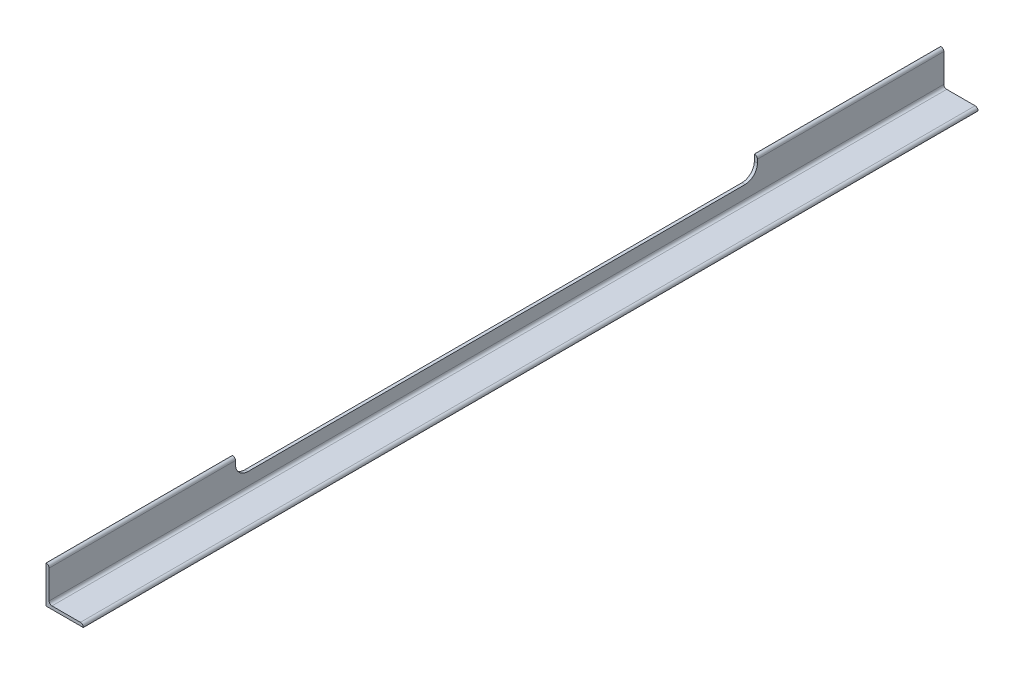
ISO-10303-21;
HEADER;
FILE_DESCRIPTION(('STEP AP214'),'2;1');
FILE_NAME('part.step','',(''),(''),'','','');
FILE_SCHEMA(('AUTOMOTIVE_DESIGN { 1 0 10303 214 1 1 1 1 }'));
ENDSEC;
DATA;
#1=APPLICATION_CONTEXT('core data for automotive mechanical design processes');
#2=APPLICATION_PROTOCOL_DEFINITION('international standard','automotive_design',2000,#1);
#3=PRODUCT_CONTEXT('',#1,'mechanical');
#4=PRODUCT('Part','Part','',(#3));
#5=PRODUCT_RELATED_PRODUCT_CATEGORY('part','',(#4));
#6=PRODUCT_DEFINITION_FORMATION('','',#4);
#7=PRODUCT_DEFINITION_CONTEXT('part definition',#1,'design');
#8=PRODUCT_DEFINITION('design','',#6,#7);
#9=PRODUCT_DEFINITION_SHAPE('','',#8);
#10=(LENGTH_UNIT() NAMED_UNIT(*) SI_UNIT(.MILLI.,.METRE.));
#11=(NAMED_UNIT(*) PLANE_ANGLE_UNIT() SI_UNIT($,.RADIAN.));
#12=(NAMED_UNIT(*) SI_UNIT($,.STERADIAN.) SOLID_ANGLE_UNIT());
#13=UNCERTAINTY_MEASURE_WITH_UNIT(LENGTH_MEASURE(1.E-05),#10,'distance_accuracy_value','');
#14=(GEOMETRIC_REPRESENTATION_CONTEXT(3) GLOBAL_UNCERTAINTY_ASSIGNED_CONTEXT((#13)) GLOBAL_UNIT_ASSIGNED_CONTEXT((#10,
#11,#12)) REPRESENTATION_CONTEXT('',''));
#15=CARTESIAN_POINT('',(0.,0.,0.));
#16=DIRECTION('',(0.,0.,1.));
#17=DIRECTION('',(1.,0.,0.));
#18=AXIS2_PLACEMENT_3D('',#15,#16,#17);
#19=CARTESIAN_POINT('',(0.508,70.358,4212.82368));
#20=DIRECTION('',(0.,0.,-1.));
#21=DIRECTION('',(-1.,0.,0.));
#22=AXIS2_PLACEMENT_3D('',#19,#20,#21);
#23=CYLINDRICAL_SURFACE('',#22,5.842);
#24=DIRECTION('',(0.,0.,-1.));
#25=VECTOR('',#24,1.);
#26=CARTESIAN_POINT('',(6.35,70.358,0.));
#27=LINE('',#26,#25);
#28=CARTESIAN_POINT('',(6.35,70.358,1447.8));
#29=VERTEX_POINT('',#28);
#30=CARTESIAN_POINT('',(6.35,70.358,1828.8));
#31=VERTEX_POINT('',#30);
#32=EDGE_CURVE('E139',#29,#31,#27,.F.);
#33=ORIENTED_EDGE('',*,*,#32,.F.);
#34=CARTESIAN_POINT('',(0.508,70.358,1447.8));
#35=DIRECTION('',(0.,0.,-1.));
#36=DIRECTION('',(-1.,0.,0.));
#37=AXIS2_PLACEMENT_3D('',#34,#35,#36);
#38=CIRCLE('',#37,5.842);
#39=CARTESIAN_POINT('',(0.508,76.2,1447.8));
#40=VERTEX_POINT('',#39);
#41=EDGE_CURVE('E19',#29,#40,#38,.F.);
#42=ORIENTED_EDGE('',*,*,#41,.T.);
#43=DIRECTION('',(0.,0.,1.));
#44=VECTOR('',#43,1.);
#45=CARTESIAN_POINT('',(0.508,76.2,0.));
#46=LINE('',#45,#44);
#47=CARTESIAN_POINT('',(0.508,76.2,1828.8));
#48=VERTEX_POINT('',#47);
#49=EDGE_CURVE('E137',#48,#40,#46,.F.);
#50=ORIENTED_EDGE('',*,*,#49,.F.);
#51=CARTESIAN_POINT('',(0.508,70.358,1828.8));
#52=DIRECTION('',(0.,0.,-1.));
#53=DIRECTION('',(-1.,0.,0.));
#54=AXIS2_PLACEMENT_3D('',#51,#52,#53);
#55=CIRCLE('',#54,5.842);
#56=EDGE_CURVE('E141',#31,#48,#55,.F.);
#57=ORIENTED_EDGE('',*,*,#56,.F.);
#58=EDGE_LOOP('',(#33,#42,#50,#57));
#59=FACE_BOUND('',#58,.T.);
#60=ADVANCED_FACE('F16',(#59),#23,.T.);
#61=CARTESIAN_POINT('',(6.35,76.2,0.));
#62=DIRECTION('',(0.,1.,0.));
#63=DIRECTION('',(0.,0.,1.));
#64=AXIS2_PLACEMENT_3D('',#61,#62,#63);
#65=PLANE('',#64);
#66=DIRECTION('',(0.,0.,1.));
#67=VECTOR('',#66,1.);
#68=CARTESIAN_POINT('',(0.,76.2,0.));
#69=LINE('',#68,#67);
#70=CARTESIAN_POINT('',(0.,76.2,381.));
#71=VERTEX_POINT('',#70);
#72=CARTESIAN_POINT('',(0.,76.2,0.));
#73=VERTEX_POINT('',#72);
#74=EDGE_CURVE('E193',#71,#73,#69,.F.);
#75=ORIENTED_EDGE('',*,*,#74,.F.);
#76=DIRECTION('',(-1.,0.,0.));
#77=VECTOR('',#76,1.);
#78=CARTESIAN_POINT('',(0.,76.2,381.));
#79=LINE('',#78,#77);
#80=CARTESIAN_POINT('',(0.508,76.2,381.));
#81=VERTEX_POINT('',#80);
#82=EDGE_CURVE('E186',#71,#81,#79,.F.);
#83=ORIENTED_EDGE('',*,*,#82,.T.);
#84=DIRECTION('',(0.,0.,-1.));
#85=VECTOR('',#84,1.);
#86=CARTESIAN_POINT('',(0.508,76.2,4212.82368));
#87=LINE('',#86,#85);
#88=CARTESIAN_POINT('',(0.508,76.2,0.));
#89=VERTEX_POINT('',#88);
#90=EDGE_CURVE('E183',#89,#81,#87,.F.);
#91=ORIENTED_EDGE('',*,*,#90,.F.);
#92=DIRECTION('',(1.,0.,0.));
#93=VECTOR('',#92,1.);
#94=CARTESIAN_POINT('',(6.35,76.2,0.));
#95=LINE('',#94,#93);
#96=EDGE_CURVE('E224',#89,#73,#95,.F.);
#97=ORIENTED_EDGE('',*,*,#96,.T.);
#98=EDGE_LOOP('',(#75,#83,#91,#97));
#99=FACE_BOUND('',#98,.T.);
#100=ADVANCED_FACE('F279',(#99),#65,.T.);
#101=CARTESIAN_POINT('',(6.35,76.2,0.));
#102=DIRECTION('',(0.,1.,0.));
#103=DIRECTION('',(0.,0.,1.));
#104=AXIS2_PLACEMENT_3D('',#101,#102,#103);
#105=PLANE('',#104);
#106=ORIENTED_EDGE('',*,*,#49,.T.);
#107=DIRECTION('',(1.,0.,0.));
#108=VECTOR('',#107,1.);
#109=CARTESIAN_POINT('',(0.,76.2,1447.8));
#110=LINE('',#109,#108);
#111=CARTESIAN_POINT('',(0.,76.2,1447.8));
#112=VERTEX_POINT('',#111);
#113=EDGE_CURVE('E134',#40,#112,#110,.F.);
#114=ORIENTED_EDGE('',*,*,#113,.T.);
#115=DIRECTION('',(0.,0.,1.));
#116=VECTOR('',#115,1.);
#117=CARTESIAN_POINT('',(0.,76.2,0.));
#118=LINE('',#117,#116);
#119=CARTESIAN_POINT('',(0.,76.2,1828.8));
#120=VERTEX_POINT('',#119);
#121=EDGE_CURVE('E206',#120,#112,#118,.F.);
#122=ORIENTED_EDGE('',*,*,#121,.F.);
#123=DIRECTION('',(1.,0.,0.));
#124=VECTOR('',#123,1.);
#125=CARTESIAN_POINT('',(0.,76.2,1828.8));
#126=LINE('',#125,#124);
#127=EDGE_CURVE('E173',#48,#120,#126,.F.);
#128=ORIENTED_EDGE('',*,*,#127,.F.);
#129=EDGE_LOOP('',(#106,#114,#122,#128));
#130=FACE_BOUND('',#129,.T.);
#131=ADVANCED_FACE('F310',(#130),#105,.T.);
#132=CARTESIAN_POINT('',(0.,63.5,1447.8));
#133=DIRECTION('',(0.,0.,1.));
#134=DIRECTION('',(1.,0.,0.));
#135=AXIS2_PLACEMENT_3D('',#132,#133,#134);
#136=PLANE('',#135);
#137=DIRECTION('',(0.,1.,0.));
#138=VECTOR('',#137,1.);
#139=CARTESIAN_POINT('',(0.,76.2,1447.8));
#140=LINE('',#139,#138);
#141=CARTESIAN_POINT('',(0.,63.5,1447.8));
#142=VERTEX_POINT('',#141);
#143=EDGE_CURVE('E209',#112,#142,#140,.F.);
#144=ORIENTED_EDGE('',*,*,#143,.F.);
#145=ORIENTED_EDGE('',*,*,#113,.F.);
#146=ORIENTED_EDGE('',*,*,#41,.F.);
#147=DIRECTION('',(0.,1.,0.));
#148=VECTOR('',#147,1.);
#149=CARTESIAN_POINT('',(6.35,6.35,1447.8));
#150=LINE('',#149,#148);
#151=CARTESIAN_POINT('',(6.35,63.5,1447.8));
#152=VERTEX_POINT('',#151);
#153=EDGE_CURVE('E132',#152,#29,#150,.T.);
#154=ORIENTED_EDGE('',*,*,#153,.F.);
#155=DIRECTION('',(-1.,0.,0.));
#156=VECTOR('',#155,1.);
#157=CARTESIAN_POINT('',(0.,63.5,1447.8));
#158=LINE('',#157,#156);
#159=EDGE_CURVE('E201',#152,#142,#158,.T.);
#160=ORIENTED_EDGE('',*,*,#159,.T.);
#161=EDGE_LOOP('',(#144,#145,#146,#154,#160));
#162=FACE_BOUND('',#161,.T.);
#163=ADVANCED_FACE('F130',(#162),#136,.F.);
#164=CARTESIAN_POINT('',(0.,63.5,1422.4));
#165=DIRECTION('',(-1.,0.,0.));
#166=DIRECTION('',(0.,0.,1.));
#167=AXIS2_PLACEMENT_3D('',#164,#165,#166);
#168=CYLINDRICAL_SURFACE('',#167,25.4);
#169=CARTESIAN_POINT('',(0.,63.5,1422.4));
#170=DIRECTION('',(-1.,0.,0.));
#171=DIRECTION('',(0.,0.,1.));
#172=AXIS2_PLACEMENT_3D('',#169,#170,#171);
#173=CIRCLE('',#172,25.4);
#174=CARTESIAN_POINT('',(0.,38.1,1422.4));
#175=VERTEX_POINT('',#174);
#176=EDGE_CURVE('E246',#142,#175,#173,.F.);
#177=ORIENTED_EDGE('',*,*,#176,.F.);
#178=ORIENTED_EDGE('',*,*,#159,.F.);
#179=CARTESIAN_POINT('',(6.35,63.5,1422.4));
#180=DIRECTION('',(-1.,0.,0.));
#181=DIRECTION('',(0.,0.,1.));
#182=AXIS2_PLACEMENT_3D('',#179,#180,#181);
#183=CIRCLE('',#182,25.4);
#184=CARTESIAN_POINT('',(6.35,38.1,1422.4));
#185=VERTEX_POINT('',#184);
#186=EDGE_CURVE('E151',#185,#152,#183,.T.);
#187=ORIENTED_EDGE('',*,*,#186,.F.);
#188=DIRECTION('',(1.,0.,0.));
#189=VECTOR('',#188,1.);
#190=CARTESIAN_POINT('',(0.,38.1,1422.4));
#191=LINE('',#190,#189);
#192=EDGE_CURVE('E199',#185,#175,#191,.F.);
#193=ORIENTED_EDGE('',*,*,#192,.T.);
#194=EDGE_LOOP('',(#177,#178,#187,#193));
#195=FACE_BOUND('',#194,.T.);
#196=ADVANCED_FACE('F438',(#195),#168,.F.);
#197=CARTESIAN_POINT('',(0.,38.1,406.4));
#198=DIRECTION('',(0.,-1.,0.));
#199=DIRECTION('',(0.,0.,-1.));
#200=AXIS2_PLACEMENT_3D('',#197,#198,#199);
#201=PLANE('',#200);
#202=DIRECTION('',(0.,0.,1.));
#203=VECTOR('',#202,1.);
#204=CARTESIAN_POINT('',(0.,38.1,0.));
#205=LINE('',#204,#203);
#206=CARTESIAN_POINT('',(0.,38.1,406.4));
#207=VERTEX_POINT('',#206);
#208=EDGE_CURVE('E245',#175,#207,#205,.F.);
#209=ORIENTED_EDGE('',*,*,#208,.F.);
#210=ORIENTED_EDGE('',*,*,#192,.F.);
#211=DIRECTION('',(0.,0.,-1.));
#212=VECTOR('',#211,1.);
#213=CARTESIAN_POINT('',(6.35,38.1,0.));
#214=LINE('',#213,#212);
#215=CARTESIAN_POINT('',(6.35,38.1,406.4));
#216=VERTEX_POINT('',#215);
#217=EDGE_CURVE('E153',#216,#185,#214,.F.);
#218=ORIENTED_EDGE('',*,*,#217,.F.);
#219=DIRECTION('',(-1.,0.,0.));
#220=VECTOR('',#219,1.);
#221=CARTESIAN_POINT('',(0.,38.1,406.4));
#222=LINE('',#221,#220);
#223=EDGE_CURVE('E192',#216,#207,#222,.T.);
#224=ORIENTED_EDGE('',*,*,#223,.T.);
#225=EDGE_LOOP('',(#209,#210,#218,#224));
#226=FACE_BOUND('',#225,.T.);
#227=ADVANCED_FACE('F429',(#226),#201,.F.);
#228=CARTESIAN_POINT('',(0.,63.5,406.4));
#229=DIRECTION('',(-1.,0.,0.));
#230=DIRECTION('',(0.,0.,1.));
#231=AXIS2_PLACEMENT_3D('',#228,#229,#230);
#232=CYLINDRICAL_SURFACE('',#231,25.4);
#233=CARTESIAN_POINT('',(0.,63.5,406.4));
#234=DIRECTION('',(-1.,0.,0.));
#235=DIRECTION('',(0.,0.,1.));
#236=AXIS2_PLACEMENT_3D('',#233,#234,#235);
#237=CIRCLE('',#236,25.4);
#238=CARTESIAN_POINT('',(0.,63.5,381.));
#239=VERTEX_POINT('',#238);
#240=EDGE_CURVE('E242',#207,#239,#237,.F.);
#241=ORIENTED_EDGE('',*,*,#240,.F.);
#242=ORIENTED_EDGE('',*,*,#223,.F.);
#243=CARTESIAN_POINT('',(6.35,63.5,406.4));
#244=DIRECTION('',(-1.,0.,0.));
#245=DIRECTION('',(0.,0.,1.));
#246=AXIS2_PLACEMENT_3D('',#243,#244,#245);
#247=CIRCLE('',#246,25.4);
#248=CARTESIAN_POINT('',(6.35,63.5,381.));
#249=VERTEX_POINT('',#248);
#250=EDGE_CURVE('E160',#249,#216,#247,.T.);
#251=ORIENTED_EDGE('',*,*,#250,.F.);
#252=DIRECTION('',(-1.,0.,0.));
#253=VECTOR('',#252,1.);
#254=CARTESIAN_POINT('',(0.,63.5,381.));
#255=LINE('',#254,#253);
#256=EDGE_CURVE('E188',#249,#239,#255,.T.);
#257=ORIENTED_EDGE('',*,*,#256,.T.);
#258=EDGE_LOOP('',(#241,#242,#251,#257));
#259=FACE_BOUND('',#258,.T.);
#260=ADVANCED_FACE('F421',(#259),#232,.F.);
#261=CARTESIAN_POINT('',(0.,76.2,381.));
#262=DIRECTION('',(0.,0.,-1.));
#263=DIRECTION('',(-1.,0.,0.));
#264=AXIS2_PLACEMENT_3D('',#261,#262,#263);
#265=PLANE('',#264);
#266=ORIENTED_EDGE('',*,*,#82,.F.);
#267=DIRECTION('',(0.,1.,0.));
#268=VECTOR('',#267,1.);
#269=CARTESIAN_POINT('',(0.,76.2,381.));
#270=LINE('',#269,#268);
#271=EDGE_CURVE('E241',#239,#71,#270,.T.);
#272=ORIENTED_EDGE('',*,*,#271,.F.);
#273=ORIENTED_EDGE('',*,*,#256,.F.);
#274=DIRECTION('',(0.,1.,0.));
#275=VECTOR('',#274,1.);
#276=CARTESIAN_POINT('',(6.35,6.35,381.));
#277=LINE('',#276,#275);
#278=CARTESIAN_POINT('',(6.35,70.358,381.));
#279=VERTEX_POINT('',#278);
#280=EDGE_CURVE('E157',#279,#249,#277,.F.);
#281=ORIENTED_EDGE('',*,*,#280,.F.);
#282=CARTESIAN_POINT('',(0.508,70.358,381.));
#283=DIRECTION('',(0.,0.,-1.));
#284=DIRECTION('',(-1.,0.,0.));
#285=AXIS2_PLACEMENT_3D('',#282,#283,#284);
#286=CIRCLE('',#285,5.842);
#287=EDGE_CURVE('E170',#81,#279,#286,.T.);
#288=ORIENTED_EDGE('',*,*,#287,.F.);
#289=EDGE_LOOP('',(#266,#272,#273,#281,#288));
#290=FACE_BOUND('',#289,.T.);
#291=ADVANCED_FACE('F270',(#290),#265,.F.);
#292=CARTESIAN_POINT('',(0.508,70.358,4212.82368));
#293=DIRECTION('',(0.,0.,-1.));
#294=DIRECTION('',(-1.,0.,0.));
#295=AXIS2_PLACEMENT_3D('',#292,#293,#294);
#296=CYLINDRICAL_SURFACE('',#295,5.842);
#297=ORIENTED_EDGE('',*,*,#90,.T.);
#298=ORIENTED_EDGE('',*,*,#287,.T.);
#299=DIRECTION('',(0.,0.,-1.));
#300=VECTOR('',#299,1.);
#301=CARTESIAN_POINT('',(6.35,70.358,0.));
#302=LINE('',#301,#300);
#303=CARTESIAN_POINT('',(6.35,70.358,0.));
#304=VERTEX_POINT('',#303);
#305=EDGE_CURVE('E163',#304,#279,#302,.F.);
#306=ORIENTED_EDGE('',*,*,#305,.F.);
#307=CARTESIAN_POINT('',(0.508,70.358,0.));
#308=DIRECTION('',(0.,0.,-1.));
#309=DIRECTION('',(-1.,0.,0.));
#310=AXIS2_PLACEMENT_3D('',#307,#308,#309);
#311=CIRCLE('',#310,5.842);
#312=EDGE_CURVE('E230',#304,#89,#311,.F.);
#313=ORIENTED_EDGE('',*,*,#312,.T.);
#314=EDGE_LOOP('',(#297,#298,#306,#313));
#315=FACE_BOUND('',#314,.T.);
#316=ADVANCED_FACE('F263',(#315),#296,.T.);
#317=CARTESIAN_POINT('',(70.358,0.508,4212.82368));
#318=DIRECTION('',(0.,0.,-1.));
#319=DIRECTION('',(-1.,0.,0.));
#320=AXIS2_PLACEMENT_3D('',#317,#318,#319);
#321=CYLINDRICAL_SURFACE('',#320,5.842);
#322=DIRECTION('',(0.,0.,-1.));
#323=VECTOR('',#322,1.);
#324=CARTESIAN_POINT('',(76.2,0.508,0.));
#325=LINE('',#324,#323);
#326=CARTESIAN_POINT('',(76.2,0.508,0.));
#327=VERTEX_POINT('',#326);
#328=CARTESIAN_POINT('',(76.2,0.508,1828.8));
#329=VERTEX_POINT('',#328);
#330=EDGE_CURVE('E171',#327,#329,#325,.F.);
#331=ORIENTED_EDGE('',*,*,#330,.F.);
#332=CARTESIAN_POINT('',(70.358,0.508,0.));
#333=DIRECTION('',(0.,0.,-1.));
#334=DIRECTION('',(-1.,0.,0.));
#335=AXIS2_PLACEMENT_3D('',#332,#333,#334);
#336=CIRCLE('',#335,5.842);
#337=CARTESIAN_POINT('',(70.358,6.35,0.));
#338=VERTEX_POINT('',#337);
#339=EDGE_CURVE('E237',#327,#338,#336,.F.);
#340=ORIENTED_EDGE('',*,*,#339,.T.);
#341=DIRECTION('',(0.,0.,1.));
#342=VECTOR('',#341,1.);
#343=CARTESIAN_POINT('',(70.358,6.35,0.));
#344=LINE('',#343,#342);
#345=CARTESIAN_POINT('',(70.358,6.35,1828.8));
#346=VERTEX_POINT('',#345);
#347=EDGE_CURVE('E167',#346,#338,#344,.F.);
#348=ORIENTED_EDGE('',*,*,#347,.F.);
#349=CARTESIAN_POINT('',(70.358,0.508,1828.8));
#350=DIRECTION('',(0.,0.,-1.));
#351=DIRECTION('',(-1.,0.,0.));
#352=AXIS2_PLACEMENT_3D('',#349,#350,#351);
#353=CIRCLE('',#352,5.842);
#354=EDGE_CURVE('E255',#329,#346,#353,.F.);
#355=ORIENTED_EDGE('',*,*,#354,.F.);
#356=EDGE_LOOP('',(#331,#340,#348,#355));
#357=FACE_BOUND('',#356,.T.);
#358=ADVANCED_FACE('F320',(#357),#321,.T.);
#359=CARTESIAN_POINT('',(76.2,6.35,0.));
#360=DIRECTION('',(0.,1.,0.));
#361=DIRECTION('',(0.,0.,1.));
#362=AXIS2_PLACEMENT_3D('',#359,#360,#361);
#363=PLANE('',#362);
#364=DIRECTION('',(1.,0.,0.));
#365=VECTOR('',#364,1.);
#366=CARTESIAN_POINT('',(0.,6.35,1828.8));
#367=LINE('',#366,#365);
#368=CARTESIAN_POINT('',(12.192,6.35,1828.8));
#369=VERTEX_POINT('',#368);
#370=EDGE_CURVE('E254',#346,#369,#367,.F.);
#371=ORIENTED_EDGE('',*,*,#370,.F.);
#372=ORIENTED_EDGE('',*,*,#347,.T.);
#373=DIRECTION('',(1.,0.,0.));
#374=VECTOR('',#373,1.);
#375=CARTESIAN_POINT('',(0.,6.35,0.));
#376=LINE('',#375,#374);
#377=CARTESIAN_POINT('',(12.192,6.35,0.));
#378=VERTEX_POINT('',#377);
#379=EDGE_CURVE('E236',#338,#378,#376,.F.);
#380=ORIENTED_EDGE('',*,*,#379,.T.);
#381=DIRECTION('',(0.,0.,1.));
#382=VECTOR('',#381,1.);
#383=CARTESIAN_POINT('',(12.192,6.35,-2384.02368));
#384=LINE('',#383,#382);
#385=EDGE_CURVE('E165',#378,#369,#384,.T.);
#386=ORIENTED_EDGE('',*,*,#385,.T.);
#387=EDGE_LOOP('',(#371,#372,#380,#386));
#388=FACE_BOUND('',#387,.T.);
#389=ADVANCED_FACE('F324',(#388),#363,.T.);
#390=CARTESIAN_POINT('',(12.192,12.192,-2384.02368));
#391=DIRECTION('',(0.,0.,1.));
#392=DIRECTION('',(1.,0.,0.));
#393=AXIS2_PLACEMENT_3D('',#390,#391,#392);
#394=CYLINDRICAL_SURFACE('',#393,5.842);
#395=ORIENTED_EDGE('',*,*,#385,.F.);
#396=CARTESIAN_POINT('',(12.192,12.192,0.));
#397=DIRECTION('',(0.,0.,1.));
#398=DIRECTION('',(1.,0.,0.));
#399=AXIS2_PLACEMENT_3D('',#396,#397,#398);
#400=CIRCLE('',#399,5.842);
#401=CARTESIAN_POINT('',(6.35,12.192,0.));
#402=VERTEX_POINT('',#401);
#403=EDGE_CURVE('E234',#378,#402,#400,.F.);
#404=ORIENTED_EDGE('',*,*,#403,.T.);
#405=DIRECTION('',(0.,0.,-1.));
#406=VECTOR('',#405,1.);
#407=CARTESIAN_POINT('',(6.35,12.192,0.));
#408=LINE('',#407,#406);
#409=CARTESIAN_POINT('',(6.35,12.192,1828.8));
#410=VERTEX_POINT('',#409);
#411=EDGE_CURVE('E145',#410,#402,#408,.T.);
#412=ORIENTED_EDGE('',*,*,#411,.F.);
#413=CARTESIAN_POINT('',(12.192,12.192,1828.8));
#414=DIRECTION('',(0.,0.,1.));
#415=DIRECTION('',(1.,0.,0.));
#416=AXIS2_PLACEMENT_3D('',#413,#414,#415);
#417=CIRCLE('',#416,5.842);
#418=EDGE_CURVE('E251',#369,#410,#417,.F.);
#419=ORIENTED_EDGE('',*,*,#418,.F.);
#420=EDGE_LOOP('',(#395,#404,#412,#419));
#421=FACE_BOUND('',#420,.T.);
#422=ADVANCED_FACE('F328',(#421),#394,.F.);
#423=CARTESIAN_POINT('',(6.35,6.35,0.));
#424=DIRECTION('',(1.,0.,0.));
#425=DIRECTION('',(0.,0.,-1.));
#426=AXIS2_PLACEMENT_3D('',#423,#424,#425);
#427=PLANE('',#426);
#428=ORIENTED_EDGE('',*,*,#305,.T.);
#429=ORIENTED_EDGE('',*,*,#280,.T.);
#430=ORIENTED_EDGE('',*,*,#250,.T.);
#431=ORIENTED_EDGE('',*,*,#217,.T.);
#432=ORIENTED_EDGE('',*,*,#186,.T.);
#433=ORIENTED_EDGE('',*,*,#153,.T.);
#434=ORIENTED_EDGE('',*,*,#32,.T.);
#435=DIRECTION('',(0.,1.,0.));
#436=VECTOR('',#435,1.);
#437=CARTESIAN_POINT('',(6.35,0.,1828.8));
#438=LINE('',#437,#436);
#439=EDGE_CURVE('E250',#410,#31,#438,.T.);
#440=ORIENTED_EDGE('',*,*,#439,.F.);
#441=ORIENTED_EDGE('',*,*,#411,.T.);
#442=DIRECTION('',(0.,1.,0.));
#443=VECTOR('',#442,1.);
#444=CARTESIAN_POINT('',(6.35,0.,0.));
#445=LINE('',#444,#443);
#446=EDGE_CURVE('E178',#402,#304,#445,.T.);
#447=ORIENTED_EDGE('',*,*,#446,.T.);
#448=EDGE_LOOP('',(#428,#429,#430,#431,#432,#433,#434,#440,#441,#447));
#449=FACE_BOUND('',#448,.T.);
#450=ADVANCED_FACE('F148',(#449),#427,.T.);
#451=CARTESIAN_POINT('',(76.2,0.,0.));
#452=DIRECTION('',(1.,0.,0.));
#453=DIRECTION('',(0.,0.,-1.));
#454=AXIS2_PLACEMENT_3D('',#451,#452,#453);
#455=PLANE('',#454);
#456=DIRECTION('',(0.,1.,0.));
#457=VECTOR('',#456,1.);
#458=CARTESIAN_POINT('',(76.2,0.,0.));
#459=LINE('',#458,#457);
#460=CARTESIAN_POINT('',(76.2,0.,0.));
#461=VERTEX_POINT('',#460);
#462=EDGE_CURVE('E229',#461,#327,#459,.T.);
#463=ORIENTED_EDGE('',*,*,#462,.T.);
#464=ORIENTED_EDGE('',*,*,#330,.T.);
#465=DIRECTION('',(0.,1.,0.));
#466=VECTOR('',#465,1.);
#467=CARTESIAN_POINT('',(76.2,0.,1828.8));
#468=LINE('',#467,#466);
#469=CARTESIAN_POINT('',(76.2,0.,1828.8));
#470=VERTEX_POINT('',#469);
#471=EDGE_CURVE('E257',#470,#329,#468,.T.);
#472=ORIENTED_EDGE('',*,*,#471,.F.);
#473=DIRECTION('',(0.,0.,-1.));
#474=VECTOR('',#473,1.);
#475=CARTESIAN_POINT('',(76.2,0.,0.));
#476=LINE('',#475,#474);
#477=EDGE_CURVE('E174',#461,#470,#476,.F.);
#478=ORIENTED_EDGE('',*,*,#477,.F.);
#479=EDGE_LOOP('',(#463,#464,#472,#478));
#480=FACE_BOUND('',#479,.T.);
#481=ADVANCED_FACE('F316',(#480),#455,.T.);
#482=CARTESIAN_POINT('',(0.,0.,1828.8));
#483=DIRECTION('',(0.,0.,1.));
#484=DIRECTION('',(1.,0.,0.));
#485=AXIS2_PLACEMENT_3D('',#482,#483,#484);
#486=PLANE('',#485);
#487=ORIENTED_EDGE('',*,*,#439,.T.);
#488=ORIENTED_EDGE('',*,*,#56,.T.);
#489=ORIENTED_EDGE('',*,*,#127,.T.);
#490=DIRECTION('',(0.,1.,0.));
#491=VECTOR('',#490,1.);
#492=CARTESIAN_POINT('',(0.,76.2,1828.8));
#493=LINE('',#492,#491);
#494=CARTESIAN_POINT('',(0.,0.,1828.8));
#495=VERTEX_POINT('',#494);
#496=EDGE_CURVE('E195',#495,#120,#493,.T.);
#497=ORIENTED_EDGE('',*,*,#496,.F.);
#498=DIRECTION('',(1.,0.,0.));
#499=VECTOR('',#498,1.);
#500=CARTESIAN_POINT('',(0.,0.,1828.8));
#501=LINE('',#500,#499);
#502=EDGE_CURVE('E177',#470,#495,#501,.F.);
#503=ORIENTED_EDGE('',*,*,#502,.F.);
#504=ORIENTED_EDGE('',*,*,#471,.T.);
#505=ORIENTED_EDGE('',*,*,#354,.T.);
#506=ORIENTED_EDGE('',*,*,#370,.T.);
#507=ORIENTED_EDGE('',*,*,#418,.T.);
#508=EDGE_LOOP('',(#487,#488,#489,#497,#503,#504,#505,#506,#507));
#509=FACE_BOUND('',#508,.T.);
#510=ADVANCED_FACE('F307',(#509),#486,.T.);
#511=CARTESIAN_POINT('',(0.,76.2,0.));
#512=DIRECTION('',(-1.,0.,0.));
#513=DIRECTION('',(0.,0.,1.));
#514=AXIS2_PLACEMENT_3D('',#511,#512,#513);
#515=PLANE('',#514);
#516=ORIENTED_EDGE('',*,*,#240,.T.);
#517=ORIENTED_EDGE('',*,*,#271,.T.);
#518=ORIENTED_EDGE('',*,*,#74,.T.);
#519=DIRECTION('',(0.,1.,0.));
#520=VECTOR('',#519,1.);
#521=CARTESIAN_POINT('',(0.,0.,0.));
#522=LINE('',#521,#520);
#523=CARTESIAN_POINT('',(0.,0.,0.));
#524=VERTEX_POINT('',#523);
#525=EDGE_CURVE('E34',#73,#524,#522,.F.);
#526=ORIENTED_EDGE('',*,*,#525,.T.);
#527=DIRECTION('',(0.,0.,-1.));
#528=VECTOR('',#527,1.);
#529=CARTESIAN_POINT('',(0.,0.,0.));
#530=LINE('',#529,#528);
#531=EDGE_CURVE('E25',#495,#524,#530,.T.);
#532=ORIENTED_EDGE('',*,*,#531,.F.);
#533=ORIENTED_EDGE('',*,*,#496,.T.);
#534=ORIENTED_EDGE('',*,*,#121,.T.);
#535=ORIENTED_EDGE('',*,*,#143,.T.);
#536=ORIENTED_EDGE('',*,*,#176,.T.);
#537=ORIENTED_EDGE('',*,*,#208,.T.);
#538=EDGE_LOOP('',(#516,#517,#518,#526,#532,#533,#534,#535,#536,#537));
#539=FACE_BOUND('',#538,.T.);
#540=ADVANCED_FACE('F281',(#539),#515,.T.);
#541=CARTESIAN_POINT('',(0.,0.,0.));
#542=DIRECTION('',(0.,0.,1.));
#543=DIRECTION('',(1.,0.,0.));
#544=AXIS2_PLACEMENT_3D('',#541,#542,#543);
#545=PLANE('',#544);
#546=ORIENTED_EDGE('',*,*,#403,.F.);
#547=ORIENTED_EDGE('',*,*,#379,.F.);
#548=ORIENTED_EDGE('',*,*,#339,.F.);
#549=ORIENTED_EDGE('',*,*,#462,.F.);
#550=DIRECTION('',(1.,0.,0.));
#551=VECTOR('',#550,1.);
#552=CARTESIAN_POINT('',(0.,0.,0.));
#553=LINE('',#552,#551);
#554=EDGE_CURVE('E11',#524,#461,#553,.T.);
#555=ORIENTED_EDGE('',*,*,#554,.F.);
#556=ORIENTED_EDGE('',*,*,#525,.F.);
#557=ORIENTED_EDGE('',*,*,#96,.F.);
#558=ORIENTED_EDGE('',*,*,#312,.F.);
#559=ORIENTED_EDGE('',*,*,#446,.F.);
#560=EDGE_LOOP('',(#546,#547,#548,#549,#555,#556,#557,#558,#559));
#561=FACE_BOUND('',#560,.T.);
#562=ADVANCED_FACE('F277',(#561),#545,.F.);
#563=CARTESIAN_POINT('',(0.,0.,0.));
#564=DIRECTION('',(0.,-1.,0.));
#565=DIRECTION('',(0.,0.,-1.));
#566=AXIS2_PLACEMENT_3D('',#563,#564,#565);
#567=PLANE('',#566);
#568=ORIENTED_EDGE('',*,*,#531,.T.);
#569=ORIENTED_EDGE('',*,*,#554,.T.);
#570=ORIENTED_EDGE('',*,*,#477,.T.);
#571=ORIENTED_EDGE('',*,*,#502,.T.);
#572=EDGE_LOOP('',(#568,#569,#570,#571));
#573=FACE_BOUND('',#572,.T.);
#574=ADVANCED_FACE('F312',(#573),#567,.T.);
#575=CLOSED_SHELL('',(#60,#100,#131,#163,#196,#227,#260,#291,#316,#358,#389,#422,#450,#481,#510,
#540,#562,#574));
#576=MANIFOLD_SOLID_BREP('B1',#575);
#577=ADVANCED_BREP_SHAPE_REPRESENTATION('',(#18,#576),#14);
#578=SHAPE_DEFINITION_REPRESENTATION(#9,#577);
ENDSEC;
END-ISO-10303-21;
